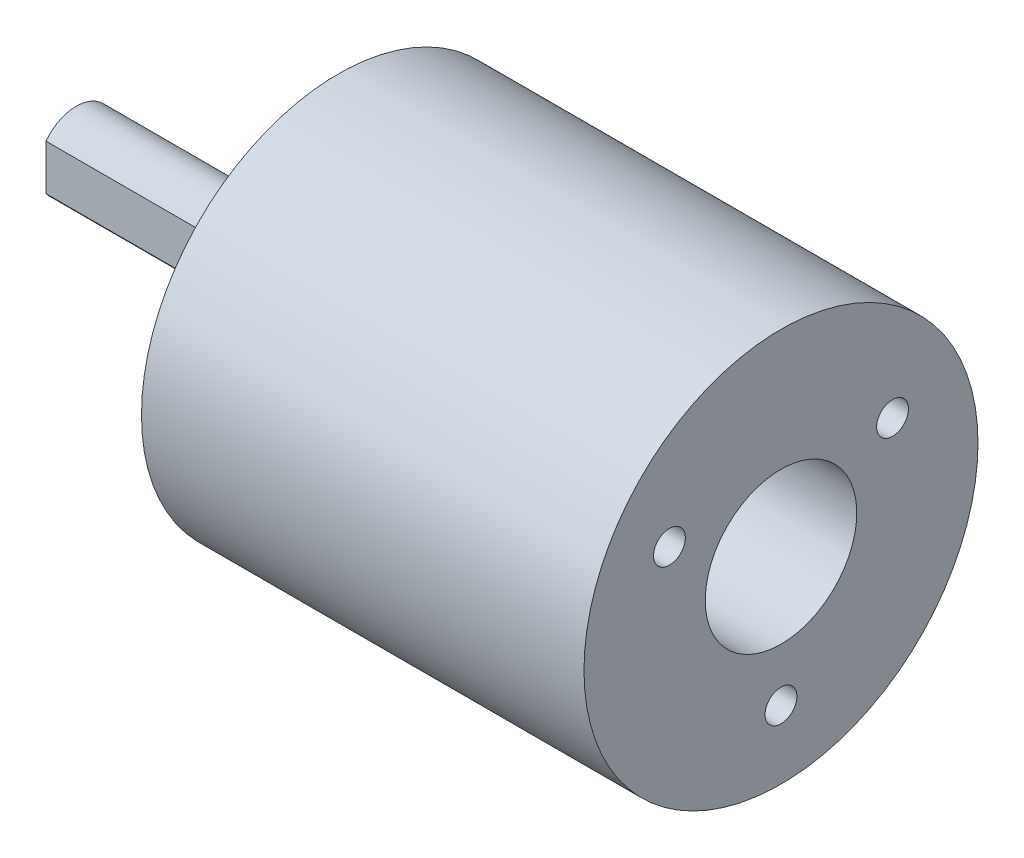
ISO-10303-21;
HEADER;
FILE_DESCRIPTION(('STEP AP214'),'2;1');
FILE_NAME('part.step','',(''),(''),'','','');
FILE_SCHEMA(('AUTOMOTIVE_DESIGN { 1 0 10303 214 1 1 1 1 }'));
ENDSEC;
DATA;
#1=APPLICATION_CONTEXT('core data for automotive mechanical design processes');
#2=APPLICATION_PROTOCOL_DEFINITION('international standard','automotive_design',2000,#1);
#3=PRODUCT_CONTEXT('',#1,'mechanical');
#4=PRODUCT('Part','Part','',(#3));
#5=PRODUCT_RELATED_PRODUCT_CATEGORY('part','',(#4));
#6=PRODUCT_DEFINITION_FORMATION('','',#4);
#7=PRODUCT_DEFINITION_CONTEXT('part definition',#1,'design');
#8=PRODUCT_DEFINITION('design','',#6,#7);
#9=PRODUCT_DEFINITION_SHAPE('','',#8);
#10=(LENGTH_UNIT() NAMED_UNIT(*) SI_UNIT(.MILLI.,.METRE.));
#11=(NAMED_UNIT(*) PLANE_ANGLE_UNIT() SI_UNIT($,.RADIAN.));
#12=(NAMED_UNIT(*) SI_UNIT($,.STERADIAN.) SOLID_ANGLE_UNIT());
#13=UNCERTAINTY_MEASURE_WITH_UNIT(LENGTH_MEASURE(1.E-05),#10,'distance_accuracy_value','');
#14=(GEOMETRIC_REPRESENTATION_CONTEXT(3) GLOBAL_UNCERTAINTY_ASSIGNED_CONTEXT((#13)) GLOBAL_UNIT_ASSIGNED_CONTEXT((#10,
#11,#12)) REPRESENTATION_CONTEXT('',''));
#15=CARTESIAN_POINT('',(0.,0.,0.));
#16=DIRECTION('',(0.,0.,1.));
#17=DIRECTION('',(1.,0.,0.));
#18=AXIS2_PLACEMENT_3D('',#15,#16,#17);
#19=CARTESIAN_POINT('',(10.6,0.,0.));
#20=DIRECTION('',(1.,0.,0.));
#21=DIRECTION('',(0.,0.,-1.));
#22=AXIS2_PLACEMENT_3D('',#19,#20,#21);
#23=CYLINDRICAL_SURFACE('',#22,5.);
#24=CARTESIAN_POINT('',(10.6,0.,0.));
#25=DIRECTION('',(1.,0.,0.));
#26=DIRECTION('',(0.,0.,-1.));
#27=AXIS2_PLACEMENT_3D('',#24,#25,#26);
#28=CIRCLE('',#27,5.);
#29=CARTESIAN_POINT('',(10.6,0.,-4.99999999999999));
#30=VERTEX_POINT('',#29);
#31=EDGE_CURVE('P0_E10',#30,#30,#28,.T.);
#32=ORIENTED_EDGE('',*,*,#31,.T.);
#33=EDGE_LOOP('',(#32));
#34=FACE_BOUND('',#33,.T.);
#35=CARTESIAN_POINT('',(20.6,0.,0.));
#36=DIRECTION('',(1.,0.,0.));
#37=DIRECTION('',(0.,0.,-1.));
#38=AXIS2_PLACEMENT_3D('',#35,#36,#37);
#39=CIRCLE('',#38,5.);
#40=CARTESIAN_POINT('',(20.6,0.,-4.99999999999999));
#41=VERTEX_POINT('',#40);
#42=EDGE_CURVE('P0_E36',#41,#41,#39,.T.);
#43=ORIENTED_EDGE('',*,*,#42,.F.);
#44=EDGE_LOOP('',(#43));
#45=FACE_BOUND('',#44,.T.);
#46=ADVANCED_FACE('P0_F33',(#34,#45),#23,.T.);
#47=CARTESIAN_POINT('',(10.6,0.,0.));
#48=DIRECTION('',(1.,0.,0.));
#49=DIRECTION('',(0.,0.,-1.));
#50=AXIS2_PLACEMENT_3D('',#47,#48,#49);
#51=PLANE('',#50);
#52=ORIENTED_EDGE('',*,*,#31,.F.);
#53=EDGE_LOOP('',(#52));
#54=FACE_BOUND('',#53,.T.);
#55=ADVANCED_FACE('P0_F48',(#54),#51,.F.);
#56=CARTESIAN_POINT('',(20.6,0.,0.));
#57=DIRECTION('',(1.,0.,0.));
#58=DIRECTION('',(0.,0.,-1.));
#59=AXIS2_PLACEMENT_3D('',#56,#57,#58);
#60=PLANE('',#59);
#61=ORIENTED_EDGE('',*,*,#42,.T.);
#62=EDGE_LOOP('',(#61));
#63=FACE_BOUND('',#62,.T.);
#64=ADVANCED_FACE('P0_F45',(#63),#60,.T.);
#65=CLOSED_SHELL('',(#46,#55,#64));
#66=MANIFOLD_SOLID_BREP('P0_B2',#65);
#67=CARTESIAN_POINT('',(5.59999999,0.,0.));
#68=DIRECTION('',(1.,0.,0.));
#69=DIRECTION('',(0.,0.,-1.));
#70=AXIS2_PLACEMENT_3D('',#67,#68,#69);
#71=CYLINDRICAL_SURFACE('',#70,13.);
#72=CARTESIAN_POINT('',(0.,0.,0.));
#73=DIRECTION('',(1.,0.,0.));
#74=DIRECTION('',(0.,0.,-1.));
#75=AXIS2_PLACEMENT_3D('',#72,#73,#74);
#76=CIRCLE('',#75,13.);
#77=CARTESIAN_POINT('',(0.,0.,-13.));
#78=VERTEX_POINT('',#77);
#79=EDGE_CURVE('P1_E11',#78,#78,#76,.T.);
#80=ORIENTED_EDGE('',*,*,#79,.T.);
#81=EDGE_LOOP('',(#80));
#82=FACE_BOUND('',#81,.T.);
#83=CARTESIAN_POINT('',(29.2,0.,0.));
#84=DIRECTION('',(1.,0.,0.));
#85=DIRECTION('',(0.,0.,-1.));
#86=AXIS2_PLACEMENT_3D('',#83,#84,#85);
#87=CIRCLE('',#86,13.);
#88=CARTESIAN_POINT('',(29.2,0.,-13.));
#89=VERTEX_POINT('',#88);
#90=EDGE_CURVE('P1_E24',#89,#89,#87,.F.);
#91=ORIENTED_EDGE('',*,*,#90,.T.);
#92=EDGE_LOOP('',(#91));
#93=FACE_BOUND('',#92,.T.);
#94=ADVANCED_FACE('P1_F16',(#82,#93),#71,.T.);
#95=CARTESIAN_POINT('',(0.,0.,13.));
#96=DIRECTION('',(-1.,0.,0.));
#97=DIRECTION('',(0.,-1.,0.));
#98=AXIS2_PLACEMENT_3D('',#95,#96,#97);
#99=PLANE('',#98);
#100=CARTESIAN_POINT('',(0.,0.,0.));
#101=DIRECTION('',(1.,0.,0.));
#102=DIRECTION('',(0.,0.,-1.));
#103=AXIS2_PLACEMENT_3D('',#100,#101,#102);
#104=CIRCLE('',#103,7.);
#105=CARTESIAN_POINT('',(0.,0.,-7.));
#106=VERTEX_POINT('',#105);
#107=EDGE_CURVE('P1_E60',#106,#106,#104,.T.);
#108=ORIENTED_EDGE('',*,*,#107,.T.);
#109=EDGE_LOOP('',(#108));
#110=FACE_BOUND('',#109,.T.);
#111=CARTESIAN_POINT('',(0.,0.,10.));
#112=DIRECTION('',(-1.,0.,0.));
#113=DIRECTION('',(0.,-1.,0.));
#114=AXIS2_PLACEMENT_3D('',#111,#112,#113);
#115=CIRCLE('',#114,1.195);
#116=CARTESIAN_POINT('',(0.,-1.195,10.));
#117=VERTEX_POINT('',#116);
#118=EDGE_CURVE('P1_E63',#117,#117,#115,.F.);
#119=ORIENTED_EDGE('',*,*,#118,.T.);
#120=EDGE_LOOP('',(#119));
#121=FACE_BOUND('',#120,.T.);
#122=CARTESIAN_POINT('',(0.,0.,-10.));
#123=DIRECTION('',(-1.,0.,0.));
#124=DIRECTION('',(0.,-1.,0.));
#125=AXIS2_PLACEMENT_3D('',#122,#123,#124);
#126=CIRCLE('',#125,1.195);
#127=CARTESIAN_POINT('',(0.,-1.195,-10.));
#128=VERTEX_POINT('',#127);
#129=EDGE_CURVE('P1_E66',#128,#128,#126,.F.);
#130=ORIENTED_EDGE('',*,*,#129,.T.);
#131=EDGE_LOOP('',(#130));
#132=FACE_BOUND('',#131,.T.);
#133=CARTESIAN_POINT('',(0.,-10.,0.));
#134=DIRECTION('',(-1.,0.,0.));
#135=DIRECTION('',(0.,-1.,0.));
#136=AXIS2_PLACEMENT_3D('',#133,#134,#135);
#137=CIRCLE('',#136,1.195);
#138=CARTESIAN_POINT('',(0.,-11.195,0.));
#139=VERTEX_POINT('',#138);
#140=EDGE_CURVE('P1_E69',#139,#139,#137,.F.);
#141=ORIENTED_EDGE('',*,*,#140,.T.);
#142=EDGE_LOOP('',(#141));
#143=FACE_BOUND('',#142,.T.);
#144=CARTESIAN_POINT('',(0.,10.,0.));
#145=DIRECTION('',(-1.,0.,0.));
#146=DIRECTION('',(0.,-1.,0.));
#147=AXIS2_PLACEMENT_3D('',#144,#145,#146);
#148=CIRCLE('',#147,1.195);
#149=CARTESIAN_POINT('',(0.,8.805,0.));
#150=VERTEX_POINT('',#149);
#151=EDGE_CURVE('P1_E72',#150,#150,#148,.F.);
#152=ORIENTED_EDGE('',*,*,#151,.T.);
#153=EDGE_LOOP('',(#152));
#154=FACE_BOUND('',#153,.T.);
#155=ORIENTED_EDGE('',*,*,#79,.F.);
#156=EDGE_LOOP('',(#155));
#157=FACE_BOUND('',#156,.T.);
#158=ADVANCED_FACE('P1_F386',(#110,#121,#132,#143,#154,#157),#99,.T.);
#159=CARTESIAN_POINT('',(29.2,0.,13.));
#160=DIRECTION('',(1.,0.,0.));
#161=DIRECTION('',(0.,0.,-1.));
#162=AXIS2_PLACEMENT_3D('',#159,#160,#161);
#163=PLANE('',#162);
#164=CARTESIAN_POINT('',(29.2,0.,0.));
#165=DIRECTION('',(-1.,0.,0.));
#166=DIRECTION('',(0.,-1.,0.));
#167=AXIS2_PLACEMENT_3D('',#164,#165,#166);
#168=CIRCLE('',#167,5.);
#169=CARTESIAN_POINT('',(29.2,-5.,0.));
#170=VERTEX_POINT('',#169);
#171=EDGE_CURVE('P1_E75',#170,#170,#168,.T.);
#172=ORIENTED_EDGE('',*,*,#171,.T.);
#173=EDGE_LOOP('',(#172));
#174=FACE_BOUND('',#173,.T.);
#175=CARTESIAN_POINT('',(29.2,-8.5,0.));
#176=DIRECTION('',(-1.,0.,0.));
#177=DIRECTION('',(0.,-1.,0.));
#178=AXIS2_PLACEMENT_3D('',#175,#176,#177);
#179=CIRCLE('',#178,1.05);
#180=CARTESIAN_POINT('',(29.2,-9.55,0.));
#181=VERTEX_POINT('',#180);
#182=EDGE_CURVE('P1_E78',#181,#181,#179,.T.);
#183=ORIENTED_EDGE('',*,*,#182,.T.);
#184=EDGE_LOOP('',(#183));
#185=FACE_BOUND('',#184,.T.);
#186=CARTESIAN_POINT('',(29.2,4.25,7.36121593217));
#187=DIRECTION('',(-1.,0.,0.));
#188=DIRECTION('',(0.,-1.,0.));
#189=AXIS2_PLACEMENT_3D('',#186,#187,#188);
#190=CIRCLE('',#189,1.05);
#191=CARTESIAN_POINT('',(29.2,3.2,7.36121593217));
#192=VERTEX_POINT('',#191);
#193=EDGE_CURVE('P1_E81',#192,#192,#190,.T.);
#194=ORIENTED_EDGE('',*,*,#193,.T.);
#195=EDGE_LOOP('',(#194));
#196=FACE_BOUND('',#195,.T.);
#197=CARTESIAN_POINT('',(29.2,4.25,-7.36121593217));
#198=DIRECTION('',(-1.,0.,0.));
#199=DIRECTION('',(0.,-1.,0.));
#200=AXIS2_PLACEMENT_3D('',#197,#198,#199);
#201=CIRCLE('',#200,1.05);
#202=CARTESIAN_POINT('',(29.2,3.2,-7.36121593217));
#203=VERTEX_POINT('',#202);
#204=EDGE_CURVE('P1_E84',#203,#203,#201,.T.);
#205=ORIENTED_EDGE('',*,*,#204,.T.);
#206=EDGE_LOOP('',(#205));
#207=FACE_BOUND('',#206,.T.);
#208=ORIENTED_EDGE('',*,*,#90,.F.);
#209=EDGE_LOOP('',(#208));
#210=FACE_BOUND('',#209,.T.);
#211=ADVANCED_FACE('P1_F375',(#174,#185,#196,#207,#210),#163,.T.);
#212=CARTESIAN_POINT('',(-2.00000001,0.,0.));
#213=DIRECTION('',(1.,0.,0.));
#214=DIRECTION('',(0.,0.,-1.));
#215=AXIS2_PLACEMENT_3D('',#212,#213,#214);
#216=CYLINDRICAL_SURFACE('',#215,7.);
#217=CARTESIAN_POINT('',(-2.,0.,0.));
#218=DIRECTION('',(1.,0.,0.));
#219=DIRECTION('',(0.,0.,-1.));
#220=AXIS2_PLACEMENT_3D('',#217,#218,#219);
#221=CIRCLE('',#220,7.);
#222=CARTESIAN_POINT('',(-2.,0.,-7.));
#223=VERTEX_POINT('',#222);
#224=EDGE_CURVE('P1_E87',#223,#223,#221,.T.);
#225=ORIENTED_EDGE('',*,*,#224,.T.);
#226=EDGE_LOOP('',(#225));
#227=FACE_BOUND('',#226,.T.);
#228=ORIENTED_EDGE('',*,*,#107,.F.);
#229=EDGE_LOOP('',(#228));
#230=FACE_BOUND('',#229,.T.);
#231=ADVANCED_FACE('P1_F364',(#227,#230),#216,.T.);
#232=CARTESIAN_POINT('',(5.00000001,0.,10.));
#233=DIRECTION('',(-1.,0.,0.));
#234=DIRECTION('',(0.,-1.,0.));
#235=AXIS2_PLACEMENT_3D('',#232,#233,#234);
#236=CYLINDRICAL_SURFACE('',#235,1.195);
#237=CARTESIAN_POINT('',(5.,0.,10.));
#238=DIRECTION('',(-1.,0.,0.));
#239=DIRECTION('',(0.,-1.,0.));
#240=AXIS2_PLACEMENT_3D('',#237,#238,#239);
#241=CIRCLE('',#240,1.195);
#242=CARTESIAN_POINT('',(5.,-1.195,10.));
#243=VERTEX_POINT('',#242);
#244=EDGE_CURVE('P1_E90',#243,#243,#241,.T.);
#245=ORIENTED_EDGE('',*,*,#244,.F.);
#246=EDGE_LOOP('',(#245));
#247=FACE_BOUND('',#246,.T.);
#248=ORIENTED_EDGE('',*,*,#118,.F.);
#249=EDGE_LOOP('',(#248));
#250=FACE_BOUND('',#249,.T.);
#251=ADVANCED_FACE('P1_F353',(#247,#250),#236,.F.);
#252=CARTESIAN_POINT('',(5.00000001,0.,-10.));
#253=DIRECTION('',(-1.,0.,0.));
#254=DIRECTION('',(0.,-1.,0.));
#255=AXIS2_PLACEMENT_3D('',#252,#253,#254);
#256=CYLINDRICAL_SURFACE('',#255,1.195);
#257=CARTESIAN_POINT('',(5.,0.,-10.));
#258=DIRECTION('',(-1.,0.,0.));
#259=DIRECTION('',(0.,-1.,0.));
#260=AXIS2_PLACEMENT_3D('',#257,#258,#259);
#261=CIRCLE('',#260,1.195);
#262=CARTESIAN_POINT('',(5.,-1.195,-10.));
#263=VERTEX_POINT('',#262);
#264=EDGE_CURVE('P1_E476',#263,#263,#261,.T.);
#265=ORIENTED_EDGE('',*,*,#264,.F.);
#266=EDGE_LOOP('',(#265));
#267=FACE_BOUND('',#266,.T.);
#268=ORIENTED_EDGE('',*,*,#129,.F.);
#269=EDGE_LOOP('',(#268));
#270=FACE_BOUND('',#269,.T.);
#271=ADVANCED_FACE('P1_F342',(#267,#270),#256,.F.);
#272=CARTESIAN_POINT('',(5.00000001,-10.,0.));
#273=DIRECTION('',(-1.,0.,0.));
#274=DIRECTION('',(0.,-1.,0.));
#275=AXIS2_PLACEMENT_3D('',#272,#273,#274);
#276=CYLINDRICAL_SURFACE('',#275,1.195);
#277=CARTESIAN_POINT('',(5.,-10.,0.));
#278=DIRECTION('',(-1.,0.,0.));
#279=DIRECTION('',(0.,-1.,0.));
#280=AXIS2_PLACEMENT_3D('',#277,#278,#279);
#281=CIRCLE('',#280,1.195);
#282=CARTESIAN_POINT('',(5.,-11.195,0.));
#283=VERTEX_POINT('',#282);
#284=EDGE_CURVE('P1_E479',#283,#283,#281,.T.);
#285=ORIENTED_EDGE('',*,*,#284,.F.);
#286=EDGE_LOOP('',(#285));
#287=FACE_BOUND('',#286,.T.);
#288=ORIENTED_EDGE('',*,*,#140,.F.);
#289=EDGE_LOOP('',(#288));
#290=FACE_BOUND('',#289,.T.);
#291=ADVANCED_FACE('P1_F331',(#287,#290),#276,.F.);
#292=CARTESIAN_POINT('',(5.00000001,10.,0.));
#293=DIRECTION('',(-1.,0.,0.));
#294=DIRECTION('',(0.,-1.,0.));
#295=AXIS2_PLACEMENT_3D('',#292,#293,#294);
#296=CYLINDRICAL_SURFACE('',#295,1.195);
#297=CARTESIAN_POINT('',(5.,10.,0.));
#298=DIRECTION('',(-1.,0.,0.));
#299=DIRECTION('',(0.,-1.,0.));
#300=AXIS2_PLACEMENT_3D('',#297,#298,#299);
#301=CIRCLE('',#300,1.195);
#302=CARTESIAN_POINT('',(5.,8.805,0.));
#303=VERTEX_POINT('',#302);
#304=EDGE_CURVE('P1_E94',#303,#303,#301,.T.);
#305=ORIENTED_EDGE('',*,*,#304,.F.);
#306=EDGE_LOOP('',(#305));
#307=FACE_BOUND('',#306,.T.);
#308=ORIENTED_EDGE('',*,*,#151,.F.);
#309=EDGE_LOOP('',(#308));
#310=FACE_BOUND('',#309,.T.);
#311=ADVANCED_FACE('P1_F320',(#307,#310),#296,.F.);
#312=CARTESIAN_POINT('',(29.20000001,0.,0.));
#313=DIRECTION('',(-1.,0.,0.));
#314=DIRECTION('',(0.,-1.,0.));
#315=AXIS2_PLACEMENT_3D('',#312,#313,#314);
#316=CYLINDRICAL_SURFACE('',#315,5.);
#317=CARTESIAN_POINT('',(20.6,0.,0.));
#318=DIRECTION('',(-1.,0.,0.));
#319=DIRECTION('',(0.,-1.,0.));
#320=AXIS2_PLACEMENT_3D('',#317,#318,#319);
#321=CIRCLE('',#320,5.);
#322=CARTESIAN_POINT('',(20.6,-5.,0.));
#323=VERTEX_POINT('',#322);
#324=EDGE_CURVE('P1_E91',#323,#323,#321,.F.);
#325=ORIENTED_EDGE('',*,*,#324,.F.);
#326=EDGE_LOOP('',(#325));
#327=FACE_BOUND('',#326,.T.);
#328=ORIENTED_EDGE('',*,*,#171,.F.);
#329=EDGE_LOOP('',(#328));
#330=FACE_BOUND('',#329,.T.);
#331=ADVANCED_FACE('P1_F309',(#327,#330),#316,.F.);
#332=CARTESIAN_POINT('',(29.20000001,-8.5,0.));
#333=DIRECTION('',(-1.,0.,0.));
#334=DIRECTION('',(0.,-1.,0.));
#335=AXIS2_PLACEMENT_3D('',#332,#333,#334);
#336=CYLINDRICAL_SURFACE('',#335,1.05);
#337=CARTESIAN_POINT('',(24.2,-8.5,0.));
#338=DIRECTION('',(-1.,0.,0.));
#339=DIRECTION('',(0.,-1.,0.));
#340=AXIS2_PLACEMENT_3D('',#337,#338,#339);
#341=CIRCLE('',#340,1.05);
#342=CARTESIAN_POINT('',(24.2,-9.55,0.));
#343=VERTEX_POINT('',#342);
#344=EDGE_CURVE('P1_E95',#343,#343,#341,.F.);
#345=ORIENTED_EDGE('',*,*,#344,.F.);
#346=EDGE_LOOP('',(#345));
#347=FACE_BOUND('',#346,.T.);
#348=ORIENTED_EDGE('',*,*,#182,.F.);
#349=EDGE_LOOP('',(#348));
#350=FACE_BOUND('',#349,.T.);
#351=ADVANCED_FACE('P1_F298',(#347,#350),#336,.F.);
#352=CARTESIAN_POINT('',(29.20000001,4.25,7.36121593217));
#353=DIRECTION('',(-1.,0.,0.));
#354=DIRECTION('',(0.,-1.,0.));
#355=AXIS2_PLACEMENT_3D('',#352,#353,#354);
#356=CYLINDRICAL_SURFACE('',#355,1.05);
#357=CARTESIAN_POINT('',(24.2,4.25,7.36121593217));
#358=DIRECTION('',(-1.,0.,0.));
#359=DIRECTION('',(0.,-1.,0.));
#360=AXIS2_PLACEMENT_3D('',#357,#358,#359);
#361=CIRCLE('',#360,1.05);
#362=CARTESIAN_POINT('',(24.2,3.2,7.36121593217));
#363=VERTEX_POINT('',#362);
#364=EDGE_CURVE('P1_E98',#363,#363,#361,.F.);
#365=ORIENTED_EDGE('',*,*,#364,.F.);
#366=EDGE_LOOP('',(#365));
#367=FACE_BOUND('',#366,.T.);
#368=ORIENTED_EDGE('',*,*,#193,.F.);
#369=EDGE_LOOP('',(#368));
#370=FACE_BOUND('',#369,.T.);
#371=ADVANCED_FACE('P1_F287',(#367,#370),#356,.F.);
#372=CARTESIAN_POINT('',(29.20000001,4.25,-7.36121593217));
#373=DIRECTION('',(-1.,0.,0.));
#374=DIRECTION('',(0.,-1.,0.));
#375=AXIS2_PLACEMENT_3D('',#372,#373,#374);
#376=CYLINDRICAL_SURFACE('',#375,1.05);
#377=CARTESIAN_POINT('',(24.2,4.25,-7.36121593217));
#378=DIRECTION('',(-1.,0.,0.));
#379=DIRECTION('',(0.,-1.,0.));
#380=AXIS2_PLACEMENT_3D('',#377,#378,#379);
#381=CIRCLE('',#380,1.05);
#382=CARTESIAN_POINT('',(24.2,3.2,-7.36121593217));
#383=VERTEX_POINT('',#382);
#384=EDGE_CURVE('P1_E101',#383,#383,#381,.F.);
#385=ORIENTED_EDGE('',*,*,#384,.F.);
#386=EDGE_LOOP('',(#385));
#387=FACE_BOUND('',#386,.T.);
#388=ORIENTED_EDGE('',*,*,#204,.F.);
#389=EDGE_LOOP('',(#388));
#390=FACE_BOUND('',#389,.T.);
#391=ADVANCED_FACE('P1_F276',(#387,#390),#376,.F.);
#392=CARTESIAN_POINT('',(-2.,7.,0.));
#393=DIRECTION('',(-1.,0.,0.));
#394=DIRECTION('',(0.,-1.,0.));
#395=AXIS2_PLACEMENT_3D('',#392,#393,#394);
#396=PLANE('',#395);
#397=CARTESIAN_POINT('',(-2.,0.,0.));
#398=DIRECTION('',(-1.,0.,0.));
#399=DIRECTION('',(0.,-1.,0.));
#400=AXIS2_PLACEMENT_3D('',#397,#398,#399);
#401=CIRCLE('',#400,5.);
#402=CARTESIAN_POINT('',(-2.,-5.,0.));
#403=VERTEX_POINT('',#402);
#404=EDGE_CURVE('P1_E104',#403,#403,#401,.F.);
#405=ORIENTED_EDGE('',*,*,#404,.T.);
#406=EDGE_LOOP('',(#405));
#407=FACE_BOUND('',#406,.T.);
#408=ORIENTED_EDGE('',*,*,#224,.F.);
#409=EDGE_LOOP('',(#408));
#410=FACE_BOUND('',#409,.T.);
#411=ADVANCED_FACE('P1_F265',(#407,#410),#396,.T.);
#412=CARTESIAN_POINT('',(5.00000000033651,0.,10.));
#413=DIRECTION('',(-1.,0.,0.));
#414=DIRECTION('',(0.,0.,1.));
#415=AXIS2_PLACEMENT_3D('',#412,#413,#414);
#416=CONICAL_SURFACE('',#415,1.19500000023209,1.02849507362514);
#417=CARTESIAN_POINT('',(5.68993357904901,0.,10.));
#418=DIRECTION('',(-1.,0.,0.));
#419=DIRECTION('',(0.,0.,-1.));
#420=AXIS2_PLACEMENT_3D('',#417,#418,#419);
#421=CIRCLE('',#420,0.0500000044303308);
#422=CARTESIAN_POINT('',(5.68993357904901,0.,9.94999999556967));
#423=VERTEX_POINT('',#422);
#424=EDGE_CURVE('P1_E107',#423,#423,#421,.T.);
#425=ORIENTED_EDGE('',*,*,#424,.F.);
#426=EDGE_LOOP('',(#425));
#427=FACE_BOUND('',#426,.T.);
#428=ORIENTED_EDGE('',*,*,#244,.T.);
#429=EDGE_LOOP('',(#428));
#430=FACE_BOUND('',#429,.T.);
#431=ADVANCED_FACE('P1_F254',(#427,#430),#416,.F.);
#432=CARTESIAN_POINT('',(5.00000000033651,0.,-10.));
#433=DIRECTION('',(-1.,0.,0.));
#434=DIRECTION('',(0.,0.,1.));
#435=AXIS2_PLACEMENT_3D('',#432,#433,#434);
#436=CONICAL_SURFACE('',#435,1.19500000021389,1.02849507362514);
#437=CARTESIAN_POINT('',(5.68993357904901,0.,-10.));
#438=DIRECTION('',(-1.,0.,0.));
#439=DIRECTION('',(0.,0.,-1.));
#440=AXIS2_PLACEMENT_3D('',#437,#438,#439);
#441=CIRCLE('',#440,0.0500000044121405);
#442=CARTESIAN_POINT('',(5.68993357904901,0.,-10.0500000044121));
#443=VERTEX_POINT('',#442);
#444=EDGE_CURVE('P1_E497',#443,#443,#441,.T.);
#445=ORIENTED_EDGE('',*,*,#444,.F.);
#446=EDGE_LOOP('',(#445));
#447=FACE_BOUND('',#446,.T.);
#448=ORIENTED_EDGE('',*,*,#264,.T.);
#449=EDGE_LOOP('',(#448));
#450=FACE_BOUND('',#449,.T.);
#451=ADVANCED_FACE('P1_F243',(#447,#450),#436,.F.);
#452=CARTESIAN_POINT('',(5.00000000033651,-10.,0.));
#453=DIRECTION('',(-1.,0.,0.));
#454=DIRECTION('',(0.,0.,1.));
#455=AXIS2_PLACEMENT_3D('',#452,#453,#454);
#456=CONICAL_SURFACE('',#455,1.19500000016615,1.02849507364708);
#457=CARTESIAN_POINT('',(5.68993357899217,-10.,0.));
#458=DIRECTION('',(-1.,0.,0.));
#459=DIRECTION('',(0.,0.,-1.));
#460=AXIS2_PLACEMENT_3D('',#457,#458,#459);
#461=CIRCLE('',#460,0.0500000043643923);
#462=CARTESIAN_POINT('',(5.68993357899217,-10.,-0.0500000043643922));
#463=VERTEX_POINT('',#462);
#464=EDGE_CURVE('P1_E503',#463,#463,#461,.T.);
#465=ORIENTED_EDGE('',*,*,#464,.F.);
#466=EDGE_LOOP('',(#465));
#467=FACE_BOUND('',#466,.T.);
#468=ORIENTED_EDGE('',*,*,#284,.T.);
#469=EDGE_LOOP('',(#468));
#470=FACE_BOUND('',#469,.T.);
#471=ADVANCED_FACE('P1_F232',(#467,#470),#456,.F.);
#472=CARTESIAN_POINT('',(5.00000000033651,10.,0.));
#473=DIRECTION('',(-1.,0.,0.));
#474=DIRECTION('',(0.,0.,1.));
#475=AXIS2_PLACEMENT_3D('',#472,#473,#474);
#476=CONICAL_SURFACE('',#475,1.19500000016615,1.02849507364708);
#477=CARTESIAN_POINT('',(5.68993357899217,10.,0.));
#478=DIRECTION('',(-1.,0.,0.));
#479=DIRECTION('',(0.,0.,-1.));
#480=AXIS2_PLACEMENT_3D('',#477,#478,#479);
#481=CIRCLE('',#480,0.0500000043643923);
#482=CARTESIAN_POINT('',(5.68993357899217,10.,-0.0500000043643922));
#483=VERTEX_POINT('',#482);
#484=EDGE_CURVE('P1_E111',#483,#483,#481,.T.);
#485=ORIENTED_EDGE('',*,*,#484,.F.);
#486=EDGE_LOOP('',(#485));
#487=FACE_BOUND('',#486,.T.);
#488=ORIENTED_EDGE('',*,*,#304,.T.);
#489=EDGE_LOOP('',(#488));
#490=FACE_BOUND('',#489,.T.);
#491=ADVANCED_FACE('P1_F221',(#487,#490),#476,.F.);
#492=CARTESIAN_POINT('',(20.6,-5.,0.));
#493=DIRECTION('',(1.,0.,0.));
#494=DIRECTION('',(0.,0.,-1.));
#495=AXIS2_PLACEMENT_3D('',#492,#493,#494);
#496=PLANE('',#495);
#497=ORIENTED_EDGE('',*,*,#324,.T.);
#498=EDGE_LOOP('',(#497));
#499=FACE_BOUND('',#498,.T.);
#500=ADVANCED_FACE('P1_F210',(#499),#496,.T.);
#501=CARTESIAN_POINT('',(24.2,-9.55,0.));
#502=DIRECTION('',(1.,0.,0.));
#503=DIRECTION('',(0.,0.,-1.));
#504=AXIS2_PLACEMENT_3D('',#501,#502,#503);
#505=PLANE('',#504);
#506=ORIENTED_EDGE('',*,*,#344,.T.);
#507=EDGE_LOOP('',(#506));
#508=FACE_BOUND('',#507,.T.);
#509=ADVANCED_FACE('P1_F199',(#508),#505,.T.);
#510=CARTESIAN_POINT('',(24.2,4.775,8.27054260614));
#511=DIRECTION('',(1.,0.,0.));
#512=DIRECTION('',(0.,0.,-1.));
#513=AXIS2_PLACEMENT_3D('',#510,#511,#512);
#514=PLANE('',#513);
#515=ORIENTED_EDGE('',*,*,#364,.T.);
#516=EDGE_LOOP('',(#515));
#517=FACE_BOUND('',#516,.T.);
#518=ADVANCED_FACE('P1_F188',(#517),#514,.T.);
#519=CARTESIAN_POINT('',(24.2,4.775,-8.27054260614));
#520=DIRECTION('',(1.,0.,0.));
#521=DIRECTION('',(0.,0.,-1.));
#522=AXIS2_PLACEMENT_3D('',#519,#520,#521);
#523=PLANE('',#522);
#524=ORIENTED_EDGE('',*,*,#384,.T.);
#525=EDGE_LOOP('',(#524));
#526=FACE_BOUND('',#525,.T.);
#527=ADVANCED_FACE('P1_F178',(#526),#523,.T.);
#528=CARTESIAN_POINT('',(-1.99999999,0.,0.));
#529=DIRECTION('',(-1.,0.,0.));
#530=DIRECTION('',(0.,-1.,0.));
#531=AXIS2_PLACEMENT_3D('',#528,#529,#530);
#532=CYLINDRICAL_SURFACE('',#531,5.);
#533=CARTESIAN_POINT('',(-4.5,0.,0.));
#534=DIRECTION('',(-1.,0.,0.));
#535=DIRECTION('',(0.,-1.,0.));
#536=AXIS2_PLACEMENT_3D('',#533,#534,#535);
#537=CIRCLE('',#536,5.);
#538=CARTESIAN_POINT('',(-4.5,-5.,0.));
#539=VERTEX_POINT('',#538);
#540=EDGE_CURVE('P1_E108',#539,#539,#537,.F.);
#541=ORIENTED_EDGE('',*,*,#540,.T.);
#542=EDGE_LOOP('',(#541));
#543=FACE_BOUND('',#542,.T.);
#544=ORIENTED_EDGE('',*,*,#404,.F.);
#545=EDGE_LOOP('',(#544));
#546=FACE_BOUND('',#545,.T.);
#547=ADVANCED_FACE('P1_F129',(#543,#546),#532,.T.);
#548=CARTESIAN_POINT('',(-4.5,0.,5.));
#549=DIRECTION('',(-1.,0.,0.));
#550=DIRECTION('',(0.,0.,1.));
#551=AXIS2_PLACEMENT_3D('',#548,#549,#550);
#552=PLANE('',#551);
#553=CARTESIAN_POINT('',(-4.5,0.,0.));
#554=DIRECTION('',(-1.,0.,0.));
#555=DIRECTION('',(0.,0.,1.));
#556=AXIS2_PLACEMENT_3D('',#553,#554,#555);
#557=CIRCLE('',#556,2.5);
#558=CARTESIAN_POINT('',(-4.5,0.,2.5));
#559=VERTEX_POINT('',#558);
#560=EDGE_CURVE('P1_E112',#559,#559,#557,.F.);
#561=ORIENTED_EDGE('',*,*,#560,.T.);
#562=EDGE_LOOP('',(#561));
#563=FACE_BOUND('',#562,.T.);
#564=ORIENTED_EDGE('',*,*,#540,.F.);
#565=EDGE_LOOP('',(#564));
#566=FACE_BOUND('',#565,.T.);
#567=ADVANCED_FACE('P1_F116',(#563,#566),#552,.T.);
#568=CARTESIAN_POINT('',(-4.49999999,0.,0.));
#569=DIRECTION('',(-1.,0.,0.));
#570=DIRECTION('',(0.,0.,1.));
#571=AXIS2_PLACEMENT_3D('',#568,#569,#570);
#572=CYLINDRICAL_SURFACE('',#571,2.5);
#573=ORIENTED_EDGE('',*,*,#560,.F.);
#574=EDGE_LOOP('',(#573));
#575=FACE_BOUND('',#574,.T.);
#576=DIRECTION('',(-1.,0.,0.));
#577=VECTOR('',#576,1.);
#578=CARTESIAN_POINT('',(-4.49999999,-1.5,2.));
#579=LINE('',#578,#577);
#580=CARTESIAN_POINT('',(-5.8,-1.5,2.));
#581=VERTEX_POINT('',#580);
#582=CARTESIAN_POINT('',(-17.3,-1.5,2.));
#583=VERTEX_POINT('',#582);
#584=EDGE_CURVE('P1_E45',#581,#583,#579,.T.);
#585=ORIENTED_EDGE('',*,*,#584,.T.);
#586=CARTESIAN_POINT('',(-17.3,0.,0.));
#587=DIRECTION('',(-1.,0.,0.));
#588=DIRECTION('',(0.,0.,1.));
#589=AXIS2_PLACEMENT_3D('',#586,#587,#588);
#590=CIRCLE('',#589,2.5);
#591=CARTESIAN_POINT('',(-17.3,1.5,2.));
#592=VERTEX_POINT('',#591);
#593=EDGE_CURVE('P1_E52',#583,#592,#590,.F.);
#594=ORIENTED_EDGE('',*,*,#593,.T.);
#595=DIRECTION('',(-1.,0.,0.));
#596=VECTOR('',#595,1.);
#597=CARTESIAN_POINT('',(-4.49999999,1.5,2.));
#598=LINE('',#597,#596);
#599=CARTESIAN_POINT('',(-5.8,1.5,2.));
#600=VERTEX_POINT('',#599);
#601=EDGE_CURVE('P1_E43',#592,#600,#598,.F.);
#602=ORIENTED_EDGE('',*,*,#601,.T.);
#603=CARTESIAN_POINT('',(-7.8,0.,0.));
#604=DIRECTION('',(-0.707106781186547,0.,0.707106781186548));
#605=DIRECTION('',(-0.707106781186548,0.,-0.707106781186547));
#606=AXIS2_PLACEMENT_3D('',#603,#604,#605);
#607=ELLIPSE('',#606,3.53553390593274,2.5);
#608=EDGE_CURVE('P1_E19',#600,#581,#607,.F.);
#609=ORIENTED_EDGE('',*,*,#608,.T.);
#610=EDGE_LOOP('',(#585,#594,#602,#609));
#611=FACE_BOUND('',#610,.T.);
#612=ADVANCED_FACE('P1_F51',(#575,#611),#572,.T.);
#613=CARTESIAN_POINT('',(-17.3,1.5,2.));
#614=DIRECTION('',(-1.,0.,0.));
#615=DIRECTION('',(0.,-1.,0.));
#616=AXIS2_PLACEMENT_3D('',#613,#614,#615);
#617=PLANE('',#616);
#618=DIRECTION('',(0.,-1.,0.));
#619=VECTOR('',#618,1.);
#620=CARTESIAN_POINT('',(-17.3,1.5,2.));
#621=LINE('',#620,#619);
#622=EDGE_CURVE('P1_E32',#583,#592,#621,.F.);
#623=ORIENTED_EDGE('',*,*,#622,.T.);
#624=ORIENTED_EDGE('',*,*,#593,.F.);
#625=EDGE_LOOP('',(#623,#624));
#626=FACE_BOUND('',#625,.T.);
#627=ADVANCED_FACE('P1_F120',(#626),#617,.T.);
#628=CARTESIAN_POINT('',(-17.3,1.5,2.));
#629=DIRECTION('',(0.,0.,1.));
#630=DIRECTION('',(1.,0.,0.));
#631=AXIS2_PLACEMENT_3D('',#628,#629,#630);
#632=PLANE('',#631);
#633=DIRECTION('',(0.,1.,0.));
#634=VECTOR('',#633,1.);
#635=CARTESIAN_POINT('',(-5.8,1.5,2.));
#636=LINE('',#635,#634);
#637=EDGE_CURVE('P1_E39',#581,#600,#636,.T.);
#638=ORIENTED_EDGE('',*,*,#637,.T.);
#639=ORIENTED_EDGE('',*,*,#601,.F.);
#640=ORIENTED_EDGE('',*,*,#622,.F.);
#641=ORIENTED_EDGE('',*,*,#584,.F.);
#642=EDGE_LOOP('',(#638,#639,#640,#641));
#643=FACE_BOUND('',#642,.T.);
#644=ADVANCED_FACE('P1_F41',(#643),#632,.T.);
#645=CARTESIAN_POINT('',(-5.8,1.5,2.));
#646=DIRECTION('',(-0.707106781186547,0.,0.707106781186548));
#647=DIRECTION('',(0.707106781186548,0.,0.707106781186547));
#648=AXIS2_PLACEMENT_3D('',#645,#646,#647);
#649=PLANE('',#648);
#650=ORIENTED_EDGE('',*,*,#637,.F.);
#651=ORIENTED_EDGE('',*,*,#608,.F.);
#652=EDGE_LOOP('',(#650,#651));
#653=FACE_BOUND('',#652,.T.);
#654=ADVANCED_FACE('P1_F17',(#653),#649,.T.);
#655=OPEN_SHELL('',(#94,#158,#211,#231,#251,#271,#291,#311,#331,#351,#371,#391,#411,#431,#451,
#471,#491,#500,#509,#518,#527,#547,#567,#612,#627,#644,#654));
#656=SHELL_BASED_SURFACE_MODEL('P1_B1',(#655));
#657=ADVANCED_BREP_SHAPE_REPRESENTATION('',(#18,#66),#14);
#658=MANIFOLD_SURFACE_SHAPE_REPRESENTATION('',(#18,#656),#14);
#659=SHAPE_REPRESENTATION('',(#18),#14);
#660=SHAPE_DEFINITION_REPRESENTATION(#9,#659);
#661=SHAPE_REPRESENTATION_RELATIONSHIP('','',#659,#657);
#662=SHAPE_REPRESENTATION_RELATIONSHIP('','',#659,#658);
ENDSEC;
END-ISO-10303-21;
